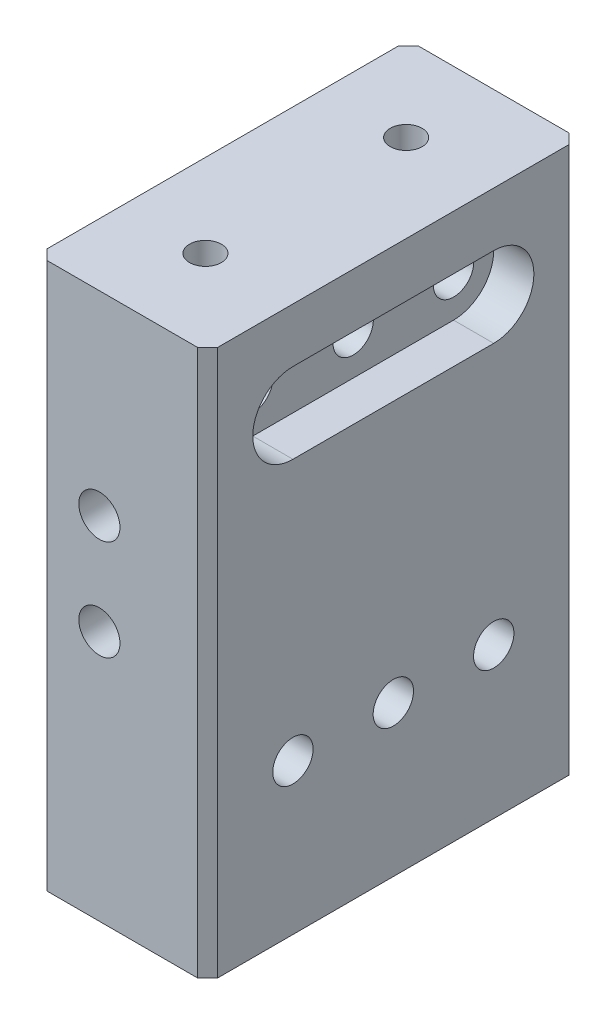
ISO-10303-21;
HEADER;
FILE_DESCRIPTION(('STEP AP214'),'2;1');
FILE_NAME('part.step','',(''),(''),'','','');
FILE_SCHEMA(('AUTOMOTIVE_DESIGN { 1 0 10303 214 1 1 1 1 }'));
ENDSEC;
DATA;
#1=APPLICATION_CONTEXT('core data for automotive mechanical design processes');
#2=APPLICATION_PROTOCOL_DEFINITION('international standard','automotive_design',2000,#1);
#3=PRODUCT_CONTEXT('',#1,'mechanical');
#4=PRODUCT('Part','Part','',(#3));
#5=PRODUCT_RELATED_PRODUCT_CATEGORY('part','',(#4));
#6=PRODUCT_DEFINITION_FORMATION('','',#4);
#7=PRODUCT_DEFINITION_CONTEXT('part definition',#1,'design');
#8=PRODUCT_DEFINITION('design','',#6,#7);
#9=PRODUCT_DEFINITION_SHAPE('','',#8);
#10=(LENGTH_UNIT() NAMED_UNIT(*) SI_UNIT(.MILLI.,.METRE.));
#11=(NAMED_UNIT(*) PLANE_ANGLE_UNIT() SI_UNIT($,.RADIAN.));
#12=(NAMED_UNIT(*) SI_UNIT($,.STERADIAN.) SOLID_ANGLE_UNIT());
#13=UNCERTAINTY_MEASURE_WITH_UNIT(LENGTH_MEASURE(1.E-05),#10,'distance_accuracy_value','');
#14=(GEOMETRIC_REPRESENTATION_CONTEXT(3) GLOBAL_UNCERTAINTY_ASSIGNED_CONTEXT((#13)) GLOBAL_UNIT_ASSIGNED_CONTEXT((#10,
#11,#12)) REPRESENTATION_CONTEXT('',''));
#15=CARTESIAN_POINT('',(0.,0.,0.));
#16=DIRECTION('',(0.,0.,1.));
#17=DIRECTION('',(1.,0.,0.));
#18=AXIS2_PLACEMENT_3D('',#15,#16,#17);
#19=CARTESIAN_POINT('',(-10.795,25.4,0.));
#20=DIRECTION('',(1.,0.,0.));
#21=DIRECTION('',(0.,0.,-1.));
#22=AXIS2_PLACEMENT_3D('',#19,#20,#21);
#23=CYLINDRICAL_SURFACE('',#22,2.5527);
#24=CARTESIAN_POINT('',(-10.795,25.4,0.));
#25=DIRECTION('',(1.,0.,0.));
#26=DIRECTION('',(0.,0.,-1.));
#27=AXIS2_PLACEMENT_3D('',#24,#25,#26);
#28=CIRCLE('',#27,2.5527);
#29=CARTESIAN_POINT('',(-10.795,25.4,-2.5527));
#30=VERTEX_POINT('',#29);
#31=EDGE_CURVE('E180',#30,#30,#28,.T.);
#32=ORIENTED_EDGE('',*,*,#31,.F.);
#33=EDGE_LOOP('',(#32));
#34=FACE_BOUND('',#33,.T.);
#35=CARTESIAN_POINT('',(5.715,25.4,0.));
#36=DIRECTION('',(1.,0.,0.));
#37=DIRECTION('',(0.,0.,-1.));
#38=AXIS2_PLACEMENT_3D('',#35,#36,#37);
#39=CIRCLE('',#38,2.5527);
#40=CARTESIAN_POINT('',(5.715,25.4,-2.5527));
#41=VERTEX_POINT('',#40);
#42=EDGE_CURVE('E177',#41,#41,#39,.F.);
#43=ORIENTED_EDGE('',*,*,#42,.F.);
#44=EDGE_LOOP('',(#43));
#45=FACE_BOUND('',#44,.T.);
#46=ADVANCED_FACE('F37',(#34,#45),#23,.F.);
#47=CARTESIAN_POINT('',(-10.795,25.4,-12.7));
#48=DIRECTION('',(1.,0.,0.));
#49=DIRECTION('',(0.,0.,-1.));
#50=AXIS2_PLACEMENT_3D('',#47,#48,#49);
#51=CYLINDRICAL_SURFACE('',#50,2.5527);
#52=CARTESIAN_POINT('',(-10.795,25.4,-12.7));
#53=DIRECTION('',(1.,0.,0.));
#54=DIRECTION('',(0.,0.,-1.));
#55=AXIS2_PLACEMENT_3D('',#52,#53,#54);
#56=CIRCLE('',#55,2.5527);
#57=CARTESIAN_POINT('',(-10.795,25.4,-15.2527));
#58=VERTEX_POINT('',#57);
#59=EDGE_CURVE('E185',#58,#58,#56,.T.);
#60=ORIENTED_EDGE('',*,*,#59,.F.);
#61=EDGE_LOOP('',(#60));
#62=FACE_BOUND('',#61,.T.);
#63=CARTESIAN_POINT('',(5.715,25.4,-12.7));
#64=DIRECTION('',(1.,0.,0.));
#65=DIRECTION('',(0.,0.,-1.));
#66=AXIS2_PLACEMENT_3D('',#63,#64,#65);
#67=CIRCLE('',#66,2.5527);
#68=CARTESIAN_POINT('',(5.715,25.4,-15.2527));
#69=VERTEX_POINT('',#68);
#70=EDGE_CURVE('E174',#69,#69,#67,.F.);
#71=ORIENTED_EDGE('',*,*,#70,.F.);
#72=EDGE_LOOP('',(#71));
#73=FACE_BOUND('',#72,.T.);
#74=ADVANCED_FACE('F352',(#62,#73),#51,.F.);
#75=CARTESIAN_POINT('',(-10.795,25.4,12.7));
#76=DIRECTION('',(1.,0.,0.));
#77=DIRECTION('',(0.,0.,-1.));
#78=AXIS2_PLACEMENT_3D('',#75,#76,#77);
#79=CYLINDRICAL_SURFACE('',#78,2.5527);
#80=CARTESIAN_POINT('',(-10.795,25.4,12.7));
#81=DIRECTION('',(1.,0.,0.));
#82=DIRECTION('',(0.,0.,-1.));
#83=AXIS2_PLACEMENT_3D('',#80,#81,#82);
#84=CIRCLE('',#83,2.5527);
#85=CARTESIAN_POINT('',(-10.795,25.4,10.1473));
#86=VERTEX_POINT('',#85);
#87=EDGE_CURVE('E181',#86,#86,#84,.T.);
#88=ORIENTED_EDGE('',*,*,#87,.F.);
#89=EDGE_LOOP('',(#88));
#90=FACE_BOUND('',#89,.T.);
#91=CARTESIAN_POINT('',(5.715,25.4,12.7));
#92=DIRECTION('',(1.,0.,0.));
#93=DIRECTION('',(0.,0.,-1.));
#94=AXIS2_PLACEMENT_3D('',#91,#92,#93);
#95=CIRCLE('',#94,2.5527);
#96=CARTESIAN_POINT('',(5.715,25.4,10.1473));
#97=VERTEX_POINT('',#96);
#98=EDGE_CURVE('E170',#97,#97,#95,.F.);
#99=ORIENTED_EDGE('',*,*,#98,.F.);
#100=EDGE_LOOP('',(#99));
#101=FACE_BOUND('',#100,.T.);
#102=ADVANCED_FACE('F314',(#90,#101),#79,.F.);
#103=CARTESIAN_POINT('',(10.795,31.75,23.495));
#104=DIRECTION('',(-1.,0.,0.));
#105=DIRECTION('',(0.,0.,1.));
#106=AXIS2_PLACEMENT_3D('',#103,#104,#105);
#107=PLANE('',#106);
#108=CARTESIAN_POINT('',(10.795,-12.7,12.7));
#109=DIRECTION('',(1.,0.,0.));
#110=DIRECTION('',(0.,0.,-1.));
#111=AXIS2_PLACEMENT_3D('',#108,#109,#110);
#112=CIRCLE('',#111,2.5527);
#113=CARTESIAN_POINT('',(10.795,-12.7,10.1473));
#114=VERTEX_POINT('',#113);
#115=EDGE_CURVE('E289',#114,#114,#112,.T.);
#116=ORIENTED_EDGE('',*,*,#115,.F.);
#117=EDGE_LOOP('',(#116));
#118=FACE_BOUND('',#117,.T.);
#119=CARTESIAN_POINT('',(10.795,-12.7,-12.7));
#120=DIRECTION('',(1.,0.,0.));
#121=DIRECTION('',(0.,0.,-1.));
#122=AXIS2_PLACEMENT_3D('',#119,#120,#121);
#123=CIRCLE('',#122,2.5527);
#124=CARTESIAN_POINT('',(10.795,-12.7,-15.2527));
#125=VERTEX_POINT('',#124);
#126=EDGE_CURVE('E295',#125,#125,#123,.T.);
#127=ORIENTED_EDGE('',*,*,#126,.F.);
#128=EDGE_LOOP('',(#127));
#129=FACE_BOUND('',#128,.T.);
#130=CARTESIAN_POINT('',(10.795,-12.7,0.));
#131=DIRECTION('',(1.,0.,0.));
#132=DIRECTION('',(0.,0.,-1.));
#133=AXIS2_PLACEMENT_3D('',#130,#131,#132);
#134=CIRCLE('',#133,2.5527);
#135=CARTESIAN_POINT('',(10.795,-12.7,-2.5527));
#136=VERTEX_POINT('',#135);
#137=EDGE_CURVE('E283',#136,#136,#134,.T.);
#138=ORIENTED_EDGE('',*,*,#137,.F.);
#139=EDGE_LOOP('',(#138));
#140=FACE_BOUND('',#139,.T.);
#141=DIRECTION('',(0.,0.,-1.));
#142=VECTOR('',#141,1.);
#143=CARTESIAN_POINT('',(10.795,20.32,12.7));
#144=LINE('',#143,#142);
#145=CARTESIAN_POINT('',(10.795,20.32,12.7));
#146=VERTEX_POINT('',#145);
#147=CARTESIAN_POINT('',(10.795,20.32,-12.7));
#148=VERTEX_POINT('',#147);
#149=EDGE_CURVE('E164',#146,#148,#144,.T.);
#150=ORIENTED_EDGE('',*,*,#149,.F.);
#151=CARTESIAN_POINT('',(10.795,25.4,12.7));
#152=DIRECTION('',(1.,0.,0.));
#153=DIRECTION('',(0.,0.,-1.));
#154=AXIS2_PLACEMENT_3D('',#151,#152,#153);
#155=CIRCLE('',#154,5.08);
#156=CARTESIAN_POINT('',(10.795,30.48,12.7));
#157=VERTEX_POINT('',#156);
#158=EDGE_CURVE('E134',#157,#146,#155,.T.);
#159=ORIENTED_EDGE('',*,*,#158,.F.);
#160=DIRECTION('',(0.,0.,1.));
#161=VECTOR('',#160,1.);
#162=CARTESIAN_POINT('',(10.795,30.48,12.7));
#163=LINE('',#162,#161);
#164=CARTESIAN_POINT('',(10.795,30.48,-12.7));
#165=VERTEX_POINT('',#164);
#166=EDGE_CURVE('E152',#165,#157,#163,.T.);
#167=ORIENTED_EDGE('',*,*,#166,.F.);
#168=CARTESIAN_POINT('',(10.795,25.4,-12.7));
#169=DIRECTION('',(1.,0.,0.));
#170=DIRECTION('',(0.,0.,-1.));
#171=AXIS2_PLACEMENT_3D('',#168,#169,#170);
#172=CIRCLE('',#171,5.08);
#173=EDGE_CURVE('E155',#148,#165,#172,.T.);
#174=ORIENTED_EDGE('',*,*,#173,.F.);
#175=EDGE_LOOP('',(#150,#159,#167,#174));
#176=FACE_BOUND('',#175,.T.);
#177=DIRECTION('',(0.,0.,-1.));
#178=VECTOR('',#177,1.);
#179=CARTESIAN_POINT('',(10.795,37.338,23.495));
#180=LINE('',#179,#178);
#181=CARTESIAN_POINT('',(10.795,37.338,22.225));
#182=VERTEX_POINT('',#181);
#183=CARTESIAN_POINT('',(10.795,37.338,-22.225));
#184=VERTEX_POINT('',#183);
#185=EDGE_CURVE('E266',#182,#184,#180,.T.);
#186=ORIENTED_EDGE('',*,*,#185,.F.);
#187=DIRECTION('',(0.,-1.,0.));
#188=VECTOR('',#187,1.);
#189=CARTESIAN_POINT('',(10.795,31.75,22.225));
#190=LINE('',#189,#188);
#191=CARTESIAN_POINT('',(10.795,-31.75,22.225));
#192=VERTEX_POINT('',#191);
#193=EDGE_CURVE('E241',#182,#192,#190,.T.);
#194=ORIENTED_EDGE('',*,*,#193,.T.);
#195=DIRECTION('',(0.,0.,-1.));
#196=VECTOR('',#195,1.);
#197=CARTESIAN_POINT('',(10.795,-31.75,23.495));
#198=LINE('',#197,#196);
#199=CARTESIAN_POINT('',(10.795,-31.75,-22.225));
#200=VERTEX_POINT('',#199);
#201=EDGE_CURVE('E193',#192,#200,#198,.T.);
#202=ORIENTED_EDGE('',*,*,#201,.T.);
#203=DIRECTION('',(0.,1.,0.));
#204=VECTOR('',#203,1.);
#205=CARTESIAN_POINT('',(10.795,31.75,-22.225));
#206=LINE('',#205,#204);
#207=EDGE_CURVE('E239',#200,#184,#206,.T.);
#208=ORIENTED_EDGE('',*,*,#207,.T.);
#209=EDGE_LOOP('',(#186,#194,#202,#208));
#210=FACE_BOUND('',#209,.T.);
#211=ADVANCED_FACE('F311',(#118,#129,#140,#176,#210),#107,.F.);
#212=CARTESIAN_POINT('',(-10.795,31.75,-23.495));
#213=DIRECTION('',(0.,0.,1.));
#214=DIRECTION('',(1.,0.,0.));
#215=AXIS2_PLACEMENT_3D('',#212,#213,#214);
#216=PLANE('',#215);
#217=CARTESIAN_POINT('',(-2.8956,12.7,-23.495));
#218=DIRECTION('',(0.,0.,1.));
#219=DIRECTION('',(1.,0.,0.));
#220=AXIS2_PLACEMENT_3D('',#217,#218,#219);
#221=CIRCLE('',#220,2.6035);
#222=CARTESIAN_POINT('',(-0.292099999999998,12.7,-23.495));
#223=VERTEX_POINT('',#222);
#224=EDGE_CURVE('E190',#223,#223,#221,.T.);
#225=ORIENTED_EDGE('',*,*,#224,.T.);
#226=EDGE_LOOP('',(#225));
#227=FACE_BOUND('',#226,.T.);
#228=CARTESIAN_POINT('',(-2.8956,0.,-23.495));
#229=DIRECTION('',(0.,0.,1.));
#230=DIRECTION('',(1.,0.,0.));
#231=AXIS2_PLACEMENT_3D('',#228,#229,#230);
#232=CIRCLE('',#231,2.6035);
#233=CARTESIAN_POINT('',(-0.292099999999997,0.,-23.495));
#234=VERTEX_POINT('',#233);
#235=EDGE_CURVE('E197',#234,#234,#232,.T.);
#236=ORIENTED_EDGE('',*,*,#235,.T.);
#237=EDGE_LOOP('',(#236));
#238=FACE_BOUND('',#237,.T.);
#239=DIRECTION('',(-1.,0.,0.));
#240=VECTOR('',#239,1.);
#241=CARTESIAN_POINT('',(-10.795,-31.75,-23.495));
#242=LINE('',#241,#240);
#243=CARTESIAN_POINT('',(9.52500000000001,-31.75,-23.495));
#244=VERTEX_POINT('',#243);
#245=CARTESIAN_POINT('',(-9.525,-31.75,-23.495));
#246=VERTEX_POINT('',#245);
#247=EDGE_CURVE('E204',#244,#246,#242,.T.);
#248=ORIENTED_EDGE('',*,*,#247,.T.);
#249=DIRECTION('',(0.,1.,0.));
#250=VECTOR('',#249,1.);
#251=CARTESIAN_POINT('',(-9.525,31.75,-23.495));
#252=LINE('',#251,#250);
#253=CARTESIAN_POINT('',(-9.525,37.338,-23.495));
#254=VERTEX_POINT('',#253);
#255=EDGE_CURVE('E11',#246,#254,#252,.T.);
#256=ORIENTED_EDGE('',*,*,#255,.T.);
#257=DIRECTION('',(-1.,0.,0.));
#258=VECTOR('',#257,1.);
#259=CARTESIAN_POINT('',(10.795,37.338,-23.495));
#260=LINE('',#259,#258);
#261=CARTESIAN_POINT('',(9.52500000000001,37.338,-23.495));
#262=VERTEX_POINT('',#261);
#263=EDGE_CURVE('E247',#262,#254,#260,.T.);
#264=ORIENTED_EDGE('',*,*,#263,.F.);
#265=DIRECTION('',(0.,-1.,0.));
#266=VECTOR('',#265,1.);
#267=CARTESIAN_POINT('',(9.52500000000001,31.75,-23.495));
#268=LINE('',#267,#266);
#269=EDGE_CURVE('E46',#262,#244,#268,.T.);
#270=ORIENTED_EDGE('',*,*,#269,.T.);
#271=EDGE_LOOP('',(#248,#256,#264,#270));
#272=FACE_BOUND('',#271,.T.);
#273=ADVANCED_FACE('F246',(#227,#238,#272),#216,.F.);
#274=CARTESIAN_POINT('',(-10.795,31.75,23.495));
#275=DIRECTION('',(1.,0.,0.));
#276=DIRECTION('',(0.,0.,-1.));
#277=AXIS2_PLACEMENT_3D('',#274,#275,#276);
#278=PLANE('',#277);
#279=CARTESIAN_POINT('',(-10.795,-12.7,12.7));
#280=DIRECTION('',(1.,0.,0.));
#281=DIRECTION('',(0.,0.,-1.));
#282=AXIS2_PLACEMENT_3D('',#279,#280,#281);
#283=CIRCLE('',#282,2.5527);
#284=CARTESIAN_POINT('',(-10.795,-12.7,10.1473));
#285=VERTEX_POINT('',#284);
#286=EDGE_CURVE('E292',#285,#285,#283,.T.);
#287=ORIENTED_EDGE('',*,*,#286,.T.);
#288=EDGE_LOOP('',(#287));
#289=FACE_BOUND('',#288,.T.);
#290=CARTESIAN_POINT('',(-10.795,-12.7,-12.7));
#291=DIRECTION('',(1.,0.,0.));
#292=DIRECTION('',(0.,0.,-1.));
#293=AXIS2_PLACEMENT_3D('',#290,#291,#292);
#294=CIRCLE('',#293,2.5527);
#295=CARTESIAN_POINT('',(-10.795,-12.7,-15.2527));
#296=VERTEX_POINT('',#295);
#297=EDGE_CURVE('E286',#296,#296,#294,.T.);
#298=ORIENTED_EDGE('',*,*,#297,.T.);
#299=EDGE_LOOP('',(#298));
#300=FACE_BOUND('',#299,.T.);
#301=CARTESIAN_POINT('',(-10.795,-12.7,0.));
#302=DIRECTION('',(1.,0.,0.));
#303=DIRECTION('',(0.,0.,-1.));
#304=AXIS2_PLACEMENT_3D('',#301,#302,#303);
#305=CIRCLE('',#304,2.5527);
#306=CARTESIAN_POINT('',(-10.795,-12.7,-2.5527));
#307=VERTEX_POINT('',#306);
#308=EDGE_CURVE('E275',#307,#307,#305,.T.);
#309=ORIENTED_EDGE('',*,*,#308,.T.);
#310=EDGE_LOOP('',(#309));
#311=FACE_BOUND('',#310,.T.);
#312=ORIENTED_EDGE('',*,*,#87,.T.);
#313=EDGE_LOOP('',(#312));
#314=FACE_BOUND('',#313,.T.);
#315=ORIENTED_EDGE('',*,*,#59,.T.);
#316=EDGE_LOOP('',(#315));
#317=FACE_BOUND('',#316,.T.);
#318=ORIENTED_EDGE('',*,*,#31,.T.);
#319=EDGE_LOOP('',(#318));
#320=FACE_BOUND('',#319,.T.);
#321=DIRECTION('',(0.,0.,1.));
#322=VECTOR('',#321,1.);
#323=CARTESIAN_POINT('',(-10.795,-31.75,23.495));
#324=LINE('',#323,#322);
#325=CARTESIAN_POINT('',(-10.795,-31.75,-22.225));
#326=VERTEX_POINT('',#325);
#327=CARTESIAN_POINT('',(-10.795,-31.75,22.225));
#328=VERTEX_POINT('',#327);
#329=EDGE_CURVE('E206',#326,#328,#324,.T.);
#330=ORIENTED_EDGE('',*,*,#329,.T.);
#331=DIRECTION('',(0.,1.,0.));
#332=VECTOR('',#331,1.);
#333=CARTESIAN_POINT('',(-10.795,31.75,22.225));
#334=LINE('',#333,#332);
#335=CARTESIAN_POINT('',(-10.795,37.338,22.225));
#336=VERTEX_POINT('',#335);
#337=EDGE_CURVE('E230',#328,#336,#334,.T.);
#338=ORIENTED_EDGE('',*,*,#337,.T.);
#339=DIRECTION('',(0.,0.,1.));
#340=VECTOR('',#339,1.);
#341=CARTESIAN_POINT('',(-10.795,37.338,-23.495));
#342=LINE('',#341,#340);
#343=CARTESIAN_POINT('',(-10.795,37.338,-22.225));
#344=VERTEX_POINT('',#343);
#345=EDGE_CURVE('E263',#344,#336,#342,.T.);
#346=ORIENTED_EDGE('',*,*,#345,.F.);
#347=DIRECTION('',(0.,-1.,0.));
#348=VECTOR('',#347,1.);
#349=CARTESIAN_POINT('',(-10.795,31.75,-22.225));
#350=LINE('',#349,#348);
#351=EDGE_CURVE('E227',#344,#326,#350,.T.);
#352=ORIENTED_EDGE('',*,*,#351,.T.);
#353=EDGE_LOOP('',(#330,#338,#346,#352));
#354=FACE_BOUND('',#353,.T.);
#355=ADVANCED_FACE('F260',(#289,#300,#311,#314,#317,#320,#354),#278,.F.);
#356=CARTESIAN_POINT('',(-10.795,31.75,23.495));
#357=DIRECTION('',(0.,0.,-1.));
#358=DIRECTION('',(-1.,0.,0.));
#359=AXIS2_PLACEMENT_3D('',#356,#357,#358);
#360=PLANE('',#359);
#361=CARTESIAN_POINT('',(-2.8956,12.7,23.495));
#362=DIRECTION('',(0.,0.,1.));
#363=DIRECTION('',(1.,0.,0.));
#364=AXIS2_PLACEMENT_3D('',#361,#362,#363);
#365=CIRCLE('',#364,2.6035);
#366=CARTESIAN_POINT('',(-0.292099999999998,12.7,23.495));
#367=VERTEX_POINT('',#366);
#368=EDGE_CURVE('E194',#367,#367,#365,.T.);
#369=ORIENTED_EDGE('',*,*,#368,.F.);
#370=EDGE_LOOP('',(#369));
#371=FACE_BOUND('',#370,.T.);
#372=CARTESIAN_POINT('',(-2.8956,0.,23.495));
#373=DIRECTION('',(0.,0.,1.));
#374=DIRECTION('',(1.,0.,0.));
#375=AXIS2_PLACEMENT_3D('',#372,#373,#374);
#376=CIRCLE('',#375,2.6035);
#377=CARTESIAN_POINT('',(-0.292099999999997,0.,23.495));
#378=VERTEX_POINT('',#377);
#379=EDGE_CURVE('E184',#378,#378,#376,.T.);
#380=ORIENTED_EDGE('',*,*,#379,.F.);
#381=EDGE_LOOP('',(#380));
#382=FACE_BOUND('',#381,.T.);
#383=DIRECTION('',(1.,0.,0.));
#384=VECTOR('',#383,1.);
#385=CARTESIAN_POINT('',(-10.795,37.338,23.495));
#386=LINE('',#385,#384);
#387=CARTESIAN_POINT('',(-9.52500000000001,37.338,23.495));
#388=VERTEX_POINT('',#387);
#389=CARTESIAN_POINT('',(9.525,37.338,23.495));
#390=VERTEX_POINT('',#389);
#391=EDGE_CURVE('E158',#388,#390,#386,.T.);
#392=ORIENTED_EDGE('',*,*,#391,.F.);
#393=DIRECTION('',(0.,-1.,0.));
#394=VECTOR('',#393,1.);
#395=CARTESIAN_POINT('',(-9.52500000000001,31.75,23.495));
#396=LINE('',#395,#394);
#397=CARTESIAN_POINT('',(-9.52500000000001,-31.75,23.495));
#398=VERTEX_POINT('',#397);
#399=EDGE_CURVE('E216',#388,#398,#396,.T.);
#400=ORIENTED_EDGE('',*,*,#399,.T.);
#401=DIRECTION('',(1.,0.,0.));
#402=VECTOR('',#401,1.);
#403=CARTESIAN_POINT('',(-10.795,-31.75,23.495));
#404=LINE('',#403,#402);
#405=CARTESIAN_POINT('',(9.525,-31.75,23.495));
#406=VERTEX_POINT('',#405);
#407=EDGE_CURVE('E209',#398,#406,#404,.T.);
#408=ORIENTED_EDGE('',*,*,#407,.T.);
#409=DIRECTION('',(0.,1.,0.));
#410=VECTOR('',#409,1.);
#411=CARTESIAN_POINT('',(9.525,31.75,23.495));
#412=LINE('',#411,#410);
#413=EDGE_CURVE('E212',#406,#390,#412,.T.);
#414=ORIENTED_EDGE('',*,*,#413,.T.);
#415=EDGE_LOOP('',(#392,#400,#408,#414));
#416=FACE_BOUND('',#415,.T.);
#417=ADVANCED_FACE('F330',(#371,#382,#416),#360,.F.);
#418=CARTESIAN_POINT('',(0.,-31.75,0.));
#419=DIRECTION('',(0.,-1.,0.));
#420=DIRECTION('',(0.,0.,-1.));
#421=AXIS2_PLACEMENT_3D('',#418,#419,#420);
#422=PLANE('',#421);
#423=ORIENTED_EDGE('',*,*,#407,.F.);
#424=DIRECTION('',(0.707106781186544,0.,0.707106781186551));
#425=VECTOR('',#424,1.);
#426=CARTESIAN_POINT('',(-16.5100000000001,-31.75,16.5099999999999));
#427=LINE('',#426,#425);
#428=EDGE_CURVE('E225',#398,#328,#427,.F.);
#429=ORIENTED_EDGE('',*,*,#428,.T.);
#430=ORIENTED_EDGE('',*,*,#329,.F.);
#431=DIRECTION('',(-0.707106781186548,0.,0.707106781186548));
#432=VECTOR('',#431,1.);
#433=CARTESIAN_POINT('',(-16.51,-31.75,-16.51));
#434=LINE('',#433,#432);
#435=EDGE_CURVE('E221',#326,#246,#434,.F.);
#436=ORIENTED_EDGE('',*,*,#435,.T.);
#437=ORIENTED_EDGE('',*,*,#247,.F.);
#438=DIRECTION('',(-0.707106781186544,0.,-0.707106781186551));
#439=VECTOR('',#438,1.);
#440=CARTESIAN_POINT('',(16.5100000000001,-31.75,-16.5099999999999));
#441=LINE('',#440,#439);
#442=EDGE_CURVE('E219',#244,#200,#441,.F.);
#443=ORIENTED_EDGE('',*,*,#442,.T.);
#444=ORIENTED_EDGE('',*,*,#201,.F.);
#445=DIRECTION('',(0.707106781186548,0.,-0.707106781186548));
#446=VECTOR('',#445,1.);
#447=CARTESIAN_POINT('',(16.51,-31.75,16.51));
#448=LINE('',#447,#446);
#449=EDGE_CURVE('E223',#192,#406,#448,.F.);
#450=ORIENTED_EDGE('',*,*,#449,.T.);
#451=EDGE_LOOP('',(#423,#429,#430,#436,#437,#443,#444,#450));
#452=FACE_BOUND('',#451,.T.);
#453=ADVANCED_FACE('F251',(#452),#422,.T.);
#454=CARTESIAN_POINT('',(-2.8956,0.,-23.495));
#455=DIRECTION('',(0.,0.,1.));
#456=DIRECTION('',(1.,0.,0.));
#457=AXIS2_PLACEMENT_3D('',#454,#455,#456);
#458=CYLINDRICAL_SURFACE('',#457,2.6035);
#459=ORIENTED_EDGE('',*,*,#235,.F.);
#460=EDGE_LOOP('',(#459));
#461=FACE_BOUND('',#460,.T.);
#462=ORIENTED_EDGE('',*,*,#379,.T.);
#463=EDGE_LOOP('',(#462));
#464=FACE_BOUND('',#463,.T.);
#465=ADVANCED_FACE('F367',(#461,#464),#458,.F.);
#466=CARTESIAN_POINT('',(-2.8956,12.7,-23.495));
#467=DIRECTION('',(0.,0.,1.));
#468=DIRECTION('',(1.,0.,0.));
#469=AXIS2_PLACEMENT_3D('',#466,#467,#468);
#470=CYLINDRICAL_SURFACE('',#469,2.6035);
#471=ORIENTED_EDGE('',*,*,#224,.F.);
#472=EDGE_LOOP('',(#471));
#473=FACE_BOUND('',#472,.T.);
#474=ORIENTED_EDGE('',*,*,#368,.T.);
#475=EDGE_LOOP('',(#474));
#476=FACE_BOUND('',#475,.T.);
#477=ADVANCED_FACE('F364',(#473,#476),#470,.F.);
#478=CARTESIAN_POINT('',(5.715,25.4,12.7));
#479=DIRECTION('',(1.,0.,0.));
#480=DIRECTION('',(0.,0.,-1.));
#481=AXIS2_PLACEMENT_3D('',#478,#479,#480);
#482=PLANE('',#481);
#483=CARTESIAN_POINT('',(5.715,25.4,12.7));
#484=DIRECTION('',(1.,0.,0.));
#485=DIRECTION('',(0.,0.,-1.));
#486=AXIS2_PLACEMENT_3D('',#483,#484,#485);
#487=CIRCLE('',#486,5.08);
#488=CARTESIAN_POINT('',(5.715,30.48,12.7));
#489=VERTEX_POINT('',#488);
#490=CARTESIAN_POINT('',(5.715,20.32,12.7));
#491=VERTEX_POINT('',#490);
#492=EDGE_CURVE('E131',#489,#491,#487,.T.);
#493=ORIENTED_EDGE('',*,*,#492,.T.);
#494=DIRECTION('',(0.,0.,-1.));
#495=VECTOR('',#494,1.);
#496=CARTESIAN_POINT('',(5.715,20.32,12.7));
#497=LINE('',#496,#495);
#498=CARTESIAN_POINT('',(5.715,20.32,-12.7));
#499=VERTEX_POINT('',#498);
#500=EDGE_CURVE('E142',#491,#499,#497,.T.);
#501=ORIENTED_EDGE('',*,*,#500,.T.);
#502=CARTESIAN_POINT('',(5.715,25.4,-12.7));
#503=DIRECTION('',(1.,0.,0.));
#504=DIRECTION('',(0.,0.,-1.));
#505=AXIS2_PLACEMENT_3D('',#502,#503,#504);
#506=CIRCLE('',#505,5.08);
#507=CARTESIAN_POINT('',(5.715,30.48,-12.7));
#508=VERTEX_POINT('',#507);
#509=EDGE_CURVE('E147',#499,#508,#506,.T.);
#510=ORIENTED_EDGE('',*,*,#509,.T.);
#511=DIRECTION('',(0.,0.,1.));
#512=VECTOR('',#511,1.);
#513=CARTESIAN_POINT('',(5.715,30.48,12.7));
#514=LINE('',#513,#512);
#515=EDGE_CURVE('E139',#508,#489,#514,.T.);
#516=ORIENTED_EDGE('',*,*,#515,.T.);
#517=EDGE_LOOP('',(#493,#501,#510,#516));
#518=FACE_BOUND('',#517,.T.);
#519=ORIENTED_EDGE('',*,*,#98,.T.);
#520=EDGE_LOOP('',(#519));
#521=FACE_BOUND('',#520,.T.);
#522=ORIENTED_EDGE('',*,*,#70,.T.);
#523=EDGE_LOOP('',(#522));
#524=FACE_BOUND('',#523,.T.);
#525=ORIENTED_EDGE('',*,*,#42,.T.);
#526=EDGE_LOOP('',(#525));
#527=FACE_BOUND('',#526,.T.);
#528=ADVANCED_FACE('F149',(#518,#521,#524,#527),#482,.T.);
#529=CARTESIAN_POINT('',(5.715,25.4,12.7));
#530=DIRECTION('',(1.,0.,0.));
#531=DIRECTION('',(0.,0.,-1.));
#532=AXIS2_PLACEMENT_3D('',#529,#530,#531);
#533=CYLINDRICAL_SURFACE('',#532,5.08);
#534=ORIENTED_EDGE('',*,*,#158,.T.);
#535=DIRECTION('',(1.,0.,0.));
#536=VECTOR('',#535,1.);
#537=CARTESIAN_POINT('',(5.715,20.32,12.7));
#538=LINE('',#537,#536);
#539=EDGE_CURVE('E127',#491,#146,#538,.T.);
#540=ORIENTED_EDGE('',*,*,#539,.F.);
#541=ORIENTED_EDGE('',*,*,#492,.F.);
#542=DIRECTION('',(1.,0.,0.));
#543=VECTOR('',#542,1.);
#544=CARTESIAN_POINT('',(5.715,30.48,12.7));
#545=LINE('',#544,#543);
#546=EDGE_CURVE('E168',#489,#157,#545,.T.);
#547=ORIENTED_EDGE('',*,*,#546,.T.);
#548=EDGE_LOOP('',(#534,#540,#541,#547));
#549=FACE_BOUND('',#548,.T.);
#550=ADVANCED_FACE('F129',(#549),#533,.F.);
#551=CARTESIAN_POINT('',(5.715,30.48,12.7));
#552=DIRECTION('',(0.,1.,0.));
#553=DIRECTION('',(0.,0.,1.));
#554=AXIS2_PLACEMENT_3D('',#551,#552,#553);
#555=PLANE('',#554);
#556=ORIENTED_EDGE('',*,*,#166,.T.);
#557=ORIENTED_EDGE('',*,*,#546,.F.);
#558=ORIENTED_EDGE('',*,*,#515,.F.);
#559=DIRECTION('',(1.,0.,0.));
#560=VECTOR('',#559,1.);
#561=CARTESIAN_POINT('',(5.715,30.48,-12.7));
#562=LINE('',#561,#560);
#563=EDGE_CURVE('E171',#508,#165,#562,.T.);
#564=ORIENTED_EDGE('',*,*,#563,.T.);
#565=EDGE_LOOP('',(#556,#557,#558,#564));
#566=FACE_BOUND('',#565,.T.);
#567=ADVANCED_FACE('F531',(#566),#555,.F.);
#568=CARTESIAN_POINT('',(5.715,25.4,-12.7));
#569=DIRECTION('',(1.,0.,0.));
#570=DIRECTION('',(0.,0.,-1.));
#571=AXIS2_PLACEMENT_3D('',#568,#569,#570);
#572=CYLINDRICAL_SURFACE('',#571,5.08);
#573=ORIENTED_EDGE('',*,*,#173,.T.);
#574=ORIENTED_EDGE('',*,*,#563,.F.);
#575=ORIENTED_EDGE('',*,*,#509,.F.);
#576=DIRECTION('',(1.,0.,0.));
#577=VECTOR('',#576,1.);
#578=CARTESIAN_POINT('',(5.715,20.32,-12.7));
#579=LINE('',#578,#577);
#580=EDGE_CURVE('E138',#499,#148,#579,.T.);
#581=ORIENTED_EDGE('',*,*,#580,.T.);
#582=EDGE_LOOP('',(#573,#574,#575,#581));
#583=FACE_BOUND('',#582,.T.);
#584=ADVANCED_FACE('F346',(#583),#572,.F.);
#585=CARTESIAN_POINT('',(5.715,20.32,12.7));
#586=DIRECTION('',(0.,-1.,0.));
#587=DIRECTION('',(0.,0.,-1.));
#588=AXIS2_PLACEMENT_3D('',#585,#586,#587);
#589=PLANE('',#588);
#590=ORIENTED_EDGE('',*,*,#149,.T.);
#591=ORIENTED_EDGE('',*,*,#580,.F.);
#592=ORIENTED_EDGE('',*,*,#500,.F.);
#593=ORIENTED_EDGE('',*,*,#539,.T.);
#594=EDGE_LOOP('',(#590,#591,#592,#593));
#595=FACE_BOUND('',#594,.T.);
#596=ADVANCED_FACE('F143',(#595),#589,.F.);
#597=CARTESIAN_POINT('',(0.,37.338,0.));
#598=DIRECTION('',(0.,1.,0.));
#599=DIRECTION('',(0.,0.,1.));
#600=AXIS2_PLACEMENT_3D('',#597,#598,#599);
#601=PLANE('',#600);
#602=CARTESIAN_POINT('',(-0.279400000000006,37.338,-12.6969262280286));
#603=DIRECTION('',(0.,1.,0.));
#604=DIRECTION('',(0.,0.,1.));
#605=AXIS2_PLACEMENT_3D('',#602,#603,#604);
#606=CIRCLE('',#605,2.0193);
#607=CARTESIAN_POINT('',(-0.279400000000006,37.338,-10.6776262280286));
#608=VERTEX_POINT('',#607);
#609=EDGE_CURVE('E278',#608,#608,#606,.T.);
#610=ORIENTED_EDGE('',*,*,#609,.F.);
#611=EDGE_LOOP('',(#610));
#612=FACE_BOUND('',#611,.T.);
#613=CARTESIAN_POINT('',(-0.279400000000006,37.338,12.6969262280286));
#614=DIRECTION('',(0.,1.,0.));
#615=DIRECTION('',(0.,0.,-1.));
#616=AXIS2_PLACEMENT_3D('',#613,#614,#615);
#617=CIRCLE('',#616,2.0193);
#618=CARTESIAN_POINT('',(-0.279400000000006,37.338,10.6776262280286));
#619=VERTEX_POINT('',#618);
#620=EDGE_CURVE('E271',#619,#619,#617,.T.);
#621=ORIENTED_EDGE('',*,*,#620,.F.);
#622=EDGE_LOOP('',(#621));
#623=FACE_BOUND('',#622,.T.);
#624=ORIENTED_EDGE('',*,*,#345,.T.);
#625=DIRECTION('',(-0.707106781186544,0.,-0.707106781186551));
#626=VECTOR('',#625,1.);
#627=CARTESIAN_POINT('',(-16.5100000000001,37.338,16.5099999999999));
#628=LINE('',#627,#626);
#629=EDGE_CURVE('E237',#336,#388,#628,.F.);
#630=ORIENTED_EDGE('',*,*,#629,.T.);
#631=ORIENTED_EDGE('',*,*,#391,.T.);
#632=DIRECTION('',(-0.707106781186548,0.,0.707106781186548));
#633=VECTOR('',#632,1.);
#634=CARTESIAN_POINT('',(16.51,37.338,16.51));
#635=LINE('',#634,#633);
#636=EDGE_CURVE('E235',#390,#182,#635,.F.);
#637=ORIENTED_EDGE('',*,*,#636,.T.);
#638=ORIENTED_EDGE('',*,*,#185,.T.);
#639=DIRECTION('',(0.707106781186544,0.,0.707106781186551));
#640=VECTOR('',#639,1.);
#641=CARTESIAN_POINT('',(16.5100000000001,37.338,-16.5099999999999));
#642=LINE('',#641,#640);
#643=EDGE_CURVE('E58',#184,#262,#642,.F.);
#644=ORIENTED_EDGE('',*,*,#643,.T.);
#645=ORIENTED_EDGE('',*,*,#263,.T.);
#646=DIRECTION('',(0.707106781186548,0.,-0.707106781186548));
#647=VECTOR('',#646,1.);
#648=CARTESIAN_POINT('',(-16.51,37.338,-16.51));
#649=LINE('',#648,#647);
#650=EDGE_CURVE('E233',#254,#344,#649,.F.);
#651=ORIENTED_EDGE('',*,*,#650,.T.);
#652=EDGE_LOOP('',(#624,#630,#631,#637,#638,#644,#645,#651));
#653=FACE_BOUND('',#652,.T.);
#654=ADVANCED_FACE('F334',(#612,#623,#653),#601,.T.);
#655=CARTESIAN_POINT('',(-0.279400000000006,32.258,12.6969262280286));
#656=DIRECTION('',(0.,1.,0.));
#657=DIRECTION('',(0.,0.,1.));
#658=AXIS2_PLACEMENT_3D('',#655,#656,#657);
#659=CYLINDRICAL_SURFACE('',#658,2.0193);
#660=CARTESIAN_POINT('',(-0.279400000000006,32.258,12.6969262280286));
#661=DIRECTION('',(0.,1.,0.));
#662=DIRECTION('',(0.,0.,-1.));
#663=AXIS2_PLACEMENT_3D('',#660,#661,#662);
#664=CIRCLE('',#663,2.0193);
#665=CARTESIAN_POINT('',(-0.279400000000006,32.258,10.6776262280286));
#666=VERTEX_POINT('',#665);
#667=EDGE_CURVE('E274',#666,#666,#664,.T.);
#668=ORIENTED_EDGE('',*,*,#667,.F.);
#669=EDGE_LOOP('',(#668));
#670=FACE_BOUND('',#669,.T.);
#671=ORIENTED_EDGE('',*,*,#620,.T.);
#672=EDGE_LOOP('',(#671));
#673=FACE_BOUND('',#672,.T.);
#674=ADVANCED_FACE('F336',(#670,#673),#659,.F.);
#675=CARTESIAN_POINT('',(-0.279400000000006,32.258,12.6969262280286));
#676=DIRECTION('',(0.,-1.,0.));
#677=DIRECTION('',(0.,0.,-1.));
#678=AXIS2_PLACEMENT_3D('',#675,#676,#677);
#679=PLANE('',#678);
#680=ORIENTED_EDGE('',*,*,#667,.T.);
#681=EDGE_LOOP('',(#680));
#682=FACE_BOUND('',#681,.T.);
#683=ADVANCED_FACE('F343',(#682),#679,.F.);
#684=CARTESIAN_POINT('',(-0.279400000000006,32.258,-12.6969262280286));
#685=DIRECTION('',(0.,1.,0.));
#686=DIRECTION('',(0.,0.,1.));
#687=AXIS2_PLACEMENT_3D('',#684,#685,#686);
#688=CYLINDRICAL_SURFACE('',#687,2.0193);
#689=CARTESIAN_POINT('',(-0.279400000000006,32.258,-12.6969262280286));
#690=DIRECTION('',(0.,1.,0.));
#691=DIRECTION('',(0.,0.,1.));
#692=AXIS2_PLACEMENT_3D('',#689,#690,#691);
#693=CIRCLE('',#692,2.0193);
#694=CARTESIAN_POINT('',(-0.279400000000006,32.258,-10.6776262280286));
#695=VERTEX_POINT('',#694);
#696=EDGE_CURVE('E270',#695,#695,#693,.T.);
#697=ORIENTED_EDGE('',*,*,#696,.F.);
#698=EDGE_LOOP('',(#697));
#699=FACE_BOUND('',#698,.T.);
#700=ORIENTED_EDGE('',*,*,#609,.T.);
#701=EDGE_LOOP('',(#700));
#702=FACE_BOUND('',#701,.T.);
#703=ADVANCED_FACE('F493',(#699,#702),#688,.F.);
#704=CARTESIAN_POINT('',(-0.279400000000006,32.258,-12.6969262280286));
#705=DIRECTION('',(0.,1.,0.));
#706=DIRECTION('',(0.,0.,1.));
#707=AXIS2_PLACEMENT_3D('',#704,#705,#706);
#708=PLANE('',#707);
#709=ORIENTED_EDGE('',*,*,#696,.T.);
#710=EDGE_LOOP('',(#709));
#711=FACE_BOUND('',#710,.T.);
#712=ADVANCED_FACE('F483',(#711),#708,.T.);
#713=CARTESIAN_POINT('',(-10.795,-12.7,0.));
#714=DIRECTION('',(1.,0.,0.));
#715=DIRECTION('',(0.,0.,-1.));
#716=AXIS2_PLACEMENT_3D('',#713,#714,#715);
#717=CYLINDRICAL_SURFACE('',#716,2.5527);
#718=ORIENTED_EDGE('',*,*,#308,.F.);
#719=EDGE_LOOP('',(#718));
#720=FACE_BOUND('',#719,.T.);
#721=ORIENTED_EDGE('',*,*,#137,.T.);
#722=EDGE_LOOP('',(#721));
#723=FACE_BOUND('',#722,.T.);
#724=ADVANCED_FACE('F307',(#720,#723),#717,.F.);
#725=CARTESIAN_POINT('',(-10.795,-12.7,-12.7));
#726=DIRECTION('',(1.,0.,0.));
#727=DIRECTION('',(0.,0.,-1.));
#728=AXIS2_PLACEMENT_3D('',#725,#726,#727);
#729=CYLINDRICAL_SURFACE('',#728,2.5527);
#730=ORIENTED_EDGE('',*,*,#297,.F.);
#731=EDGE_LOOP('',(#730));
#732=FACE_BOUND('',#731,.T.);
#733=ORIENTED_EDGE('',*,*,#126,.T.);
#734=EDGE_LOOP('',(#733));
#735=FACE_BOUND('',#734,.T.);
#736=ADVANCED_FACE('F303',(#732,#735),#729,.F.);
#737=CARTESIAN_POINT('',(-10.795,-12.7,12.7));
#738=DIRECTION('',(1.,0.,0.));
#739=DIRECTION('',(0.,0.,-1.));
#740=AXIS2_PLACEMENT_3D('',#737,#738,#739);
#741=CYLINDRICAL_SURFACE('',#740,2.5527);
#742=ORIENTED_EDGE('',*,*,#286,.F.);
#743=EDGE_LOOP('',(#742));
#744=FACE_BOUND('',#743,.T.);
#745=ORIENTED_EDGE('',*,*,#115,.T.);
#746=EDGE_LOOP('',(#745));
#747=FACE_BOUND('',#746,.T.);
#748=ADVANCED_FACE('F306',(#744,#747),#741,.F.);
#749=CARTESIAN_POINT('',(-9.52500000000001,31.75,23.495));
#750=DIRECTION('',(0.707106781186551,0.,-0.707106781186544));
#751=DIRECTION('',(0.,-1.,0.));
#752=AXIS2_PLACEMENT_3D('',#749,#750,#751);
#753=PLANE('',#752);
#754=ORIENTED_EDGE('',*,*,#629,.F.);
#755=ORIENTED_EDGE('',*,*,#337,.F.);
#756=ORIENTED_EDGE('',*,*,#428,.F.);
#757=ORIENTED_EDGE('',*,*,#399,.F.);
#758=EDGE_LOOP('',(#754,#755,#756,#757));
#759=FACE_BOUND('',#758,.T.);
#760=ADVANCED_FACE('F333',(#759),#753,.F.);
#761=CARTESIAN_POINT('',(10.795,31.75,22.225));
#762=DIRECTION('',(-0.707106781186548,0.,-0.707106781186548));
#763=DIRECTION('',(0.,-1.,0.));
#764=AXIS2_PLACEMENT_3D('',#761,#762,#763);
#765=PLANE('',#764);
#766=ORIENTED_EDGE('',*,*,#636,.F.);
#767=ORIENTED_EDGE('',*,*,#413,.F.);
#768=ORIENTED_EDGE('',*,*,#449,.F.);
#769=ORIENTED_EDGE('',*,*,#193,.F.);
#770=EDGE_LOOP('',(#766,#767,#768,#769));
#771=FACE_BOUND('',#770,.T.);
#772=ADVANCED_FACE('F326',(#771),#765,.F.);
#773=CARTESIAN_POINT('',(-10.795,31.75,-22.225));
#774=DIRECTION('',(0.707106781186548,0.,0.707106781186548));
#775=DIRECTION('',(0.,-1.,0.));
#776=AXIS2_PLACEMENT_3D('',#773,#774,#775);
#777=PLANE('',#776);
#778=ORIENTED_EDGE('',*,*,#650,.F.);
#779=ORIENTED_EDGE('',*,*,#255,.F.);
#780=ORIENTED_EDGE('',*,*,#435,.F.);
#781=ORIENTED_EDGE('',*,*,#351,.F.);
#782=EDGE_LOOP('',(#778,#779,#780,#781));
#783=FACE_BOUND('',#782,.T.);
#784=ADVANCED_FACE('F257',(#783),#777,.F.);
#785=CARTESIAN_POINT('',(9.52500000000001,31.75,-23.495));
#786=DIRECTION('',(-0.707106781186551,0.,0.707106781186544));
#787=DIRECTION('',(0.,-1.,0.));
#788=AXIS2_PLACEMENT_3D('',#785,#786,#787);
#789=PLANE('',#788);
#790=ORIENTED_EDGE('',*,*,#643,.F.);
#791=ORIENTED_EDGE('',*,*,#207,.F.);
#792=ORIENTED_EDGE('',*,*,#442,.F.);
#793=ORIENTED_EDGE('',*,*,#269,.F.);
#794=EDGE_LOOP('',(#790,#791,#792,#793));
#795=FACE_BOUND('',#794,.T.);
#796=ADVANCED_FACE('F40',(#795),#789,.F.);
#797=CLOSED_SHELL('',(#46,#74,#102,#211,#273,#355,#417,#453,#465,#477,#528,#550,#567,#584,#596,
#654,#674,#683,#703,#712,#724,#736,#748,#760,#772,#784,#796));
#798=MANIFOLD_SOLID_BREP('B2',#797);
#799=ADVANCED_BREP_SHAPE_REPRESENTATION('',(#18,#798),#14);
#800=SHAPE_DEFINITION_REPRESENTATION(#9,#799);
ENDSEC;
END-ISO-10303-21;
